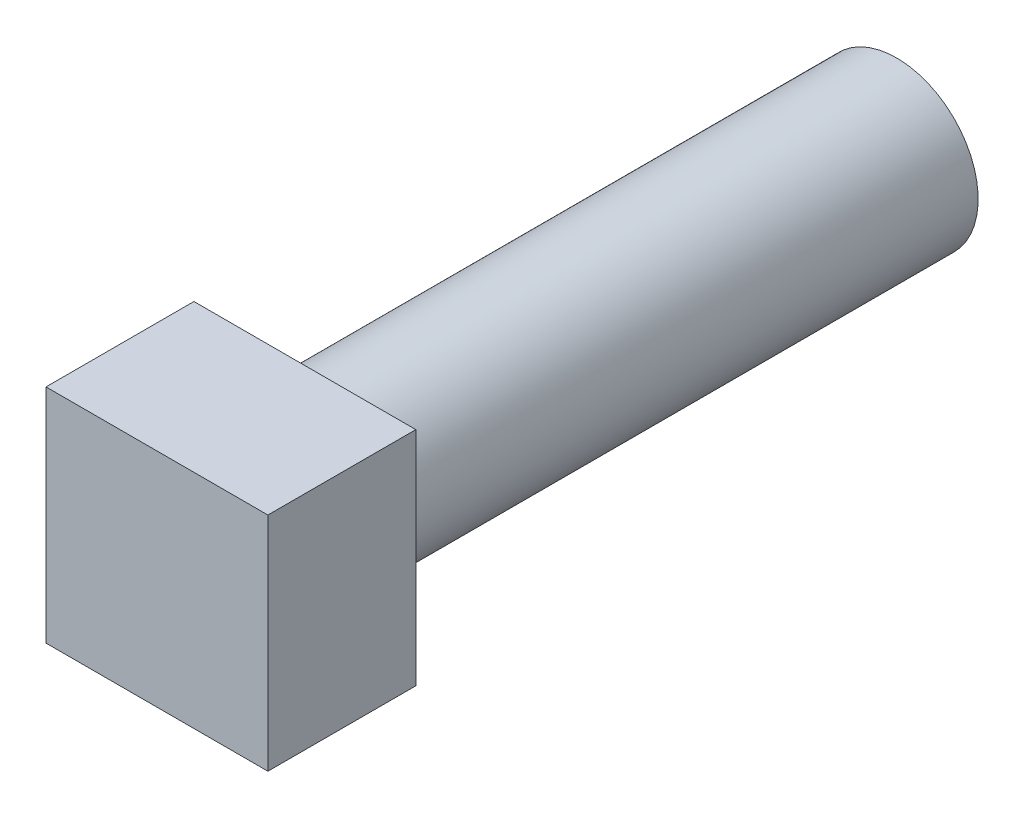
ISO-10303-21;
HEADER;
FILE_DESCRIPTION(('STEP AP214'),'2;1');
FILE_NAME('part.step','',(''),(''),'','','');
FILE_SCHEMA(('AUTOMOTIVE_DESIGN { 1 0 10303 214 1 1 1 1 }'));
ENDSEC;
DATA;
#1=APPLICATION_CONTEXT('core data for automotive mechanical design processes');
#2=APPLICATION_PROTOCOL_DEFINITION('international standard','automotive_design',2000,#1);
#3=PRODUCT_CONTEXT('',#1,'mechanical');
#4=PRODUCT('Part','Part','',(#3));
#5=PRODUCT_RELATED_PRODUCT_CATEGORY('part','',(#4));
#6=PRODUCT_DEFINITION_FORMATION('','',#4);
#7=PRODUCT_DEFINITION_CONTEXT('part definition',#1,'design');
#8=PRODUCT_DEFINITION('design','',#6,#7);
#9=PRODUCT_DEFINITION_SHAPE('','',#8);
#10=(LENGTH_UNIT() NAMED_UNIT(*) SI_UNIT(.MILLI.,.METRE.));
#11=(NAMED_UNIT(*) PLANE_ANGLE_UNIT() SI_UNIT($,.RADIAN.));
#12=(NAMED_UNIT(*) SI_UNIT($,.STERADIAN.) SOLID_ANGLE_UNIT());
#13=UNCERTAINTY_MEASURE_WITH_UNIT(LENGTH_MEASURE(1.E-05),#10,'distance_accuracy_value','');
#14=(GEOMETRIC_REPRESENTATION_CONTEXT(3) GLOBAL_UNCERTAINTY_ASSIGNED_CONTEXT((#13)) GLOBAL_UNIT_ASSIGNED_CONTEXT((#10,
#11,#12)) REPRESENTATION_CONTEXT('',''));
#15=CARTESIAN_POINT('',(0.,0.,0.));
#16=DIRECTION('',(0.,0.,1.));
#17=DIRECTION('',(1.,0.,0.));
#18=AXIS2_PLACEMENT_3D('',#15,#16,#17);
#19=CARTESIAN_POINT('',(4.7625,-4.7625,6.35));
#20=DIRECTION('',(-1.,0.,0.));
#21=DIRECTION('',(0.,0.,1.));
#22=AXIS2_PLACEMENT_3D('',#19,#20,#21);
#23=PLANE('',#22);
#24=DIRECTION('',(0.,1.,0.));
#25=VECTOR('',#24,1.);
#26=CARTESIAN_POINT('',(4.7625,-4.7625,0.));
#27=LINE('',#26,#25);
#28=CARTESIAN_POINT('',(4.7625,-4.7625,0.));
#29=VERTEX_POINT('',#28);
#30=CARTESIAN_POINT('',(4.7625,4.7625,0.));
#31=VERTEX_POINT('',#30);
#32=EDGE_CURVE('E110',#29,#31,#27,.T.);
#33=ORIENTED_EDGE('',*,*,#32,.T.);
#34=DIRECTION('',(0.,0.,-1.));
#35=VECTOR('',#34,1.);
#36=CARTESIAN_POINT('',(4.7625,4.7625,6.35));
#37=LINE('',#36,#35);
#38=CARTESIAN_POINT('',(4.7625,4.7625,6.35));
#39=VERTEX_POINT('',#38);
#40=EDGE_CURVE('E42',#39,#31,#37,.T.);
#41=ORIENTED_EDGE('',*,*,#40,.F.);
#42=DIRECTION('',(0.,1.,0.));
#43=VECTOR('',#42,1.);
#44=CARTESIAN_POINT('',(4.7625,-4.7625,6.35));
#45=LINE('',#44,#43);
#46=CARTESIAN_POINT('',(4.7625,-4.7625,6.35));
#47=VERTEX_POINT('',#46);
#48=EDGE_CURVE('E93',#47,#39,#45,.T.);
#49=ORIENTED_EDGE('',*,*,#48,.F.);
#50=DIRECTION('',(0.,0.,-1.));
#51=VECTOR('',#50,1.);
#52=CARTESIAN_POINT('',(4.7625,-4.7625,6.35));
#53=LINE('',#52,#51);
#54=EDGE_CURVE('E106',#47,#29,#53,.T.);
#55=ORIENTED_EDGE('',*,*,#54,.T.);
#56=EDGE_LOOP('',(#33,#41,#49,#55));
#57=FACE_BOUND('',#56,.T.);
#58=ADVANCED_FACE('F39',(#57),#23,.F.);
#59=CARTESIAN_POINT('',(-4.7625,4.7625,6.35));
#60=DIRECTION('',(0.,-1.,0.));
#61=DIRECTION('',(0.,0.,-1.));
#62=AXIS2_PLACEMENT_3D('',#59,#60,#61);
#63=PLANE('',#62);
#64=DIRECTION('',(-1.,0.,0.));
#65=VECTOR('',#64,1.);
#66=CARTESIAN_POINT('',(-4.7625,4.7625,0.));
#67=LINE('',#66,#65);
#68=CARTESIAN_POINT('',(-4.7625,4.7625,0.));
#69=VERTEX_POINT('',#68);
#70=EDGE_CURVE('E99',#31,#69,#67,.T.);
#71=ORIENTED_EDGE('',*,*,#70,.T.);
#72=DIRECTION('',(0.,0.,-1.));
#73=VECTOR('',#72,1.);
#74=CARTESIAN_POINT('',(-4.7625,4.7625,6.35));
#75=LINE('',#74,#73);
#76=CARTESIAN_POINT('',(-4.7625,4.7625,6.35));
#77=VERTEX_POINT('',#76);
#78=EDGE_CURVE('E97',#77,#69,#75,.T.);
#79=ORIENTED_EDGE('',*,*,#78,.F.);
#80=DIRECTION('',(-1.,0.,0.));
#81=VECTOR('',#80,1.);
#82=CARTESIAN_POINT('',(-4.7625,4.7625,6.35));
#83=LINE('',#82,#81);
#84=EDGE_CURVE('E88',#39,#77,#83,.T.);
#85=ORIENTED_EDGE('',*,*,#84,.F.);
#86=ORIENTED_EDGE('',*,*,#40,.T.);
#87=EDGE_LOOP('',(#71,#79,#85,#86));
#88=FACE_BOUND('',#87,.T.);
#89=ADVANCED_FACE('F98',(#88),#63,.F.);
#90=CARTESIAN_POINT('',(-4.7625,-4.7625,6.35));
#91=DIRECTION('',(1.,0.,0.));
#92=DIRECTION('',(0.,0.,-1.));
#93=AXIS2_PLACEMENT_3D('',#90,#91,#92);
#94=PLANE('',#93);
#95=DIRECTION('',(0.,-1.,0.));
#96=VECTOR('',#95,1.);
#97=CARTESIAN_POINT('',(-4.7625,-4.7625,0.));
#98=LINE('',#97,#96);
#99=CARTESIAN_POINT('',(-4.7625,-4.7625,0.));
#100=VERTEX_POINT('',#99);
#101=EDGE_CURVE('E74',#69,#100,#98,.T.);
#102=ORIENTED_EDGE('',*,*,#101,.T.);
#103=DIRECTION('',(0.,0.,-1.));
#104=VECTOR('',#103,1.);
#105=CARTESIAN_POINT('',(-4.7625,-4.7625,6.35));
#106=LINE('',#105,#104);
#107=CARTESIAN_POINT('',(-4.7625,-4.7625,6.35));
#108=VERTEX_POINT('',#107);
#109=EDGE_CURVE('E101',#108,#100,#106,.T.);
#110=ORIENTED_EDGE('',*,*,#109,.F.);
#111=DIRECTION('',(0.,-1.,0.));
#112=VECTOR('',#111,1.);
#113=CARTESIAN_POINT('',(-4.7625,-4.7625,6.35));
#114=LINE('',#113,#112);
#115=EDGE_CURVE('E91',#77,#108,#114,.T.);
#116=ORIENTED_EDGE('',*,*,#115,.F.);
#117=ORIENTED_EDGE('',*,*,#78,.T.);
#118=EDGE_LOOP('',(#102,#110,#116,#117));
#119=FACE_BOUND('',#118,.T.);
#120=ADVANCED_FACE('F102',(#119),#94,.F.);
#121=CARTESIAN_POINT('',(-4.7625,-4.7625,6.35));
#122=DIRECTION('',(0.,1.,0.));
#123=DIRECTION('',(0.,0.,1.));
#124=AXIS2_PLACEMENT_3D('',#121,#122,#123);
#125=PLANE('',#124);
#126=DIRECTION('',(1.,0.,0.));
#127=VECTOR('',#126,1.);
#128=CARTESIAN_POINT('',(-4.7625,-4.7625,0.));
#129=LINE('',#128,#127);
#130=EDGE_CURVE('E80',#100,#29,#129,.T.);
#131=ORIENTED_EDGE('',*,*,#130,.T.);
#132=ORIENTED_EDGE('',*,*,#54,.F.);
#133=DIRECTION('',(1.,0.,0.));
#134=VECTOR('',#133,1.);
#135=CARTESIAN_POINT('',(-4.7625,-4.7625,6.35));
#136=LINE('',#135,#134);
#137=EDGE_CURVE('E57',#108,#47,#136,.T.);
#138=ORIENTED_EDGE('',*,*,#137,.F.);
#139=ORIENTED_EDGE('',*,*,#109,.T.);
#140=EDGE_LOOP('',(#131,#132,#138,#139));
#141=FACE_BOUND('',#140,.T.);
#142=ADVANCED_FACE('F124',(#141),#125,.F.);
#143=CARTESIAN_POINT('',(0.,0.,6.35));
#144=DIRECTION('',(0.,0.,-1.));
#145=DIRECTION('',(-1.,0.,0.));
#146=AXIS2_PLACEMENT_3D('',#143,#144,#145);
#147=PLANE('',#146);
#148=ORIENTED_EDGE('',*,*,#48,.T.);
#149=ORIENTED_EDGE('',*,*,#84,.T.);
#150=ORIENTED_EDGE('',*,*,#115,.T.);
#151=ORIENTED_EDGE('',*,*,#137,.T.);
#152=EDGE_LOOP('',(#148,#149,#150,#151));
#153=FACE_BOUND('',#152,.T.);
#154=ADVANCED_FACE('F89',(#153),#147,.F.);
#155=CARTESIAN_POINT('',(0.,0.,0.));
#156=DIRECTION('',(0.,0.,-1.));
#157=DIRECTION('',(-1.,0.,0.));
#158=AXIS2_PLACEMENT_3D('',#155,#156,#157);
#159=PLANE('',#158);
#160=CARTESIAN_POINT('',(0.,0.,0.));
#161=DIRECTION('',(0.,0.,-1.));
#162=DIRECTION('',(-1.,0.,0.));
#163=AXIS2_PLACEMENT_3D('',#160,#161,#162);
#164=CIRCLE('',#163,3.5);
#165=CARTESIAN_POINT('',(-3.5,0.,0.));
#166=VERTEX_POINT('',#165);
#167=EDGE_CURVE('E11',#166,#166,#164,.T.);
#168=ORIENTED_EDGE('',*,*,#167,.F.);
#169=EDGE_LOOP('',(#168));
#170=FACE_BOUND('',#169,.T.);
#171=ORIENTED_EDGE('',*,*,#32,.F.);
#172=ORIENTED_EDGE('',*,*,#130,.F.);
#173=ORIENTED_EDGE('',*,*,#101,.F.);
#174=ORIENTED_EDGE('',*,*,#70,.F.);
#175=EDGE_LOOP('',(#171,#172,#173,#174));
#176=FACE_BOUND('',#175,.T.);
#177=ADVANCED_FACE('F127',(#170,#176),#159,.T.);
#178=CARTESIAN_POINT('',(0.,0.,-25.4));
#179=DIRECTION('',(0.,0.,1.));
#180=DIRECTION('',(1.,0.,0.));
#181=AXIS2_PLACEMENT_3D('',#178,#179,#180);
#182=CYLINDRICAL_SURFACE('',#181,3.5);
#183=CARTESIAN_POINT('',(0.,0.,-25.4));
#184=DIRECTION('',(0.,0.,-1.));
#185=DIRECTION('',(-1.,0.,0.));
#186=AXIS2_PLACEMENT_3D('',#183,#184,#185);
#187=CIRCLE('',#186,3.5);
#188=CARTESIAN_POINT('',(-3.5,0.,-25.4));
#189=VERTEX_POINT('',#188);
#190=EDGE_CURVE('E114',#189,#189,#187,.T.);
#191=ORIENTED_EDGE('',*,*,#190,.F.);
#192=EDGE_LOOP('',(#191));
#193=FACE_BOUND('',#192,.T.);
#194=ORIENTED_EDGE('',*,*,#167,.T.);
#195=EDGE_LOOP('',(#194));
#196=FACE_BOUND('',#195,.T.);
#197=ADVANCED_FACE('F137',(#193,#196),#182,.T.);
#198=CARTESIAN_POINT('',(0.,0.,-25.4));
#199=DIRECTION('',(0.,0.,-1.));
#200=DIRECTION('',(-1.,0.,0.));
#201=AXIS2_PLACEMENT_3D('',#198,#199,#200);
#202=PLANE('',#201);
#203=ORIENTED_EDGE('',*,*,#190,.T.);
#204=EDGE_LOOP('',(#203));
#205=FACE_BOUND('',#204,.T.);
#206=ADVANCED_FACE('F135',(#205),#202,.T.);
#207=CLOSED_SHELL('',(#58,#89,#120,#142,#154,#177,#197,#206));
#208=MANIFOLD_SOLID_BREP('B2',#207);
#209=ADVANCED_BREP_SHAPE_REPRESENTATION('',(#18,#208),#14);
#210=SHAPE_DEFINITION_REPRESENTATION(#9,#209);
ENDSEC;
END-ISO-10303-21;
